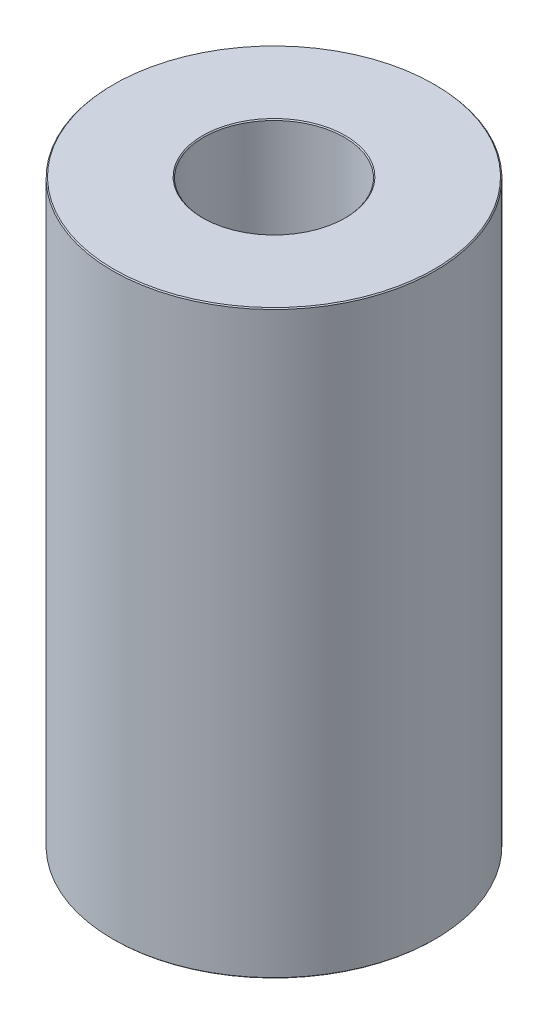
ISO-10303-21;
HEADER;
FILE_DESCRIPTION(('STEP AP214'),'2;1');
FILE_NAME('part.step','',(''),(''),'','','');
FILE_SCHEMA(('AUTOMOTIVE_DESIGN { 1 0 10303 214 1 1 1 1 }'));
ENDSEC;
DATA;
#1=APPLICATION_CONTEXT('core data for automotive mechanical design processes');
#2=APPLICATION_PROTOCOL_DEFINITION('international standard','automotive_design',2000,#1);
#3=PRODUCT_CONTEXT('',#1,'mechanical');
#4=PRODUCT('Part','Part','',(#3));
#5=PRODUCT_RELATED_PRODUCT_CATEGORY('part','',(#4));
#6=PRODUCT_DEFINITION_FORMATION('','',#4);
#7=PRODUCT_DEFINITION_CONTEXT('part definition',#1,'design');
#8=PRODUCT_DEFINITION('design','',#6,#7);
#9=PRODUCT_DEFINITION_SHAPE('','',#8);
#10=(LENGTH_UNIT() NAMED_UNIT(*) SI_UNIT(.MILLI.,.METRE.));
#11=(NAMED_UNIT(*) PLANE_ANGLE_UNIT() SI_UNIT($,.RADIAN.));
#12=(NAMED_UNIT(*) SI_UNIT($,.STERADIAN.) SOLID_ANGLE_UNIT());
#13=UNCERTAINTY_MEASURE_WITH_UNIT(LENGTH_MEASURE(1.E-05),#10,'distance_accuracy_value','');
#14=(GEOMETRIC_REPRESENTATION_CONTEXT(3) GLOBAL_UNCERTAINTY_ASSIGNED_CONTEXT((#13)) GLOBAL_UNIT_ASSIGNED_CONTEXT((#10,
#11,#12)) REPRESENTATION_CONTEXT('',''));
#15=CARTESIAN_POINT('',(0.,0.,0.));
#16=DIRECTION('',(0.,0.,1.));
#17=DIRECTION('',(1.,0.,0.));
#18=AXIS2_PLACEMENT_3D('',#15,#16,#17);
#19=CARTESIAN_POINT('',(0.,216.148202146825,0.));
#20=DIRECTION('',(0.,-1.,0.));
#21=DIRECTION('',(0.,0.,-1.));
#22=AXIS2_PLACEMENT_3D('',#19,#20,#21);
#23=CYLINDRICAL_SURFACE('',#22,60.);
#24=CARTESIAN_POINT('',(0.,0.368936859768521,0.));
#25=DIRECTION('',(0.,1.,0.));
#26=DIRECTION('',(0.,0.,1.));
#27=AXIS2_PLACEMENT_3D('',#24,#25,#26);
#28=CIRCLE('',#27,60.);
#29=CARTESIAN_POINT('',(0.,0.368936859768493,-60.));
#30=VERTEX_POINT('',#29);
#31=EDGE_CURVE('E10',#30,#30,#28,.T.);
#32=CARTESIAN_POINT('',(0.,215.779265287057,0.));
#33=DIRECTION('',(0.,1.,0.));
#34=DIRECTION('',(0.,0.,1.));
#35=AXIS2_PLACEMENT_3D('',#32,#33,#34);
#36=CIRCLE('',#35,60.);
#37=CARTESIAN_POINT('',(0.,215.779265287057,-60.));
#38=VERTEX_POINT('',#37);
#39=EDGE_CURVE('E50',#38,#38,#36,.F.);
#40=CARTESIAN_POINT('',(0.,0.368936859768493,-60.));
#41=CARTESIAN_POINT('',(0.,2.61279444755275,-60.));
#42=CARTESIAN_POINT('',(0.,4.856652035337,-60.));
#43=CARTESIAN_POINT('',(0.,9.34436721090551,-60.));
#44=CARTESIAN_POINT('',(0.,11.5882247986898,-60.));
#45=CARTESIAN_POINT('',(0.,16.0759399742583,-60.));
#46=CARTESIAN_POINT('',(0.,18.3197975620425,-60.));
#47=CARTESIAN_POINT('',(0.,22.807512737611,-60.));
#48=CARTESIAN_POINT('',(0.,25.0513703253953,-60.));
#49=CARTESIAN_POINT('',(0.,29.5390855009638,-60.));
#50=CARTESIAN_POINT('',(0.,31.782943088748,-60.));
#51=CARTESIAN_POINT('',(0.,36.2706582643165,-60.));
#52=CARTESIAN_POINT('',(0.,38.5145158521008,-60.));
#53=CARTESIAN_POINT('',(0.,43.0022310276693,-60.));
#54=CARTESIAN_POINT('',(0.,45.2460886154535,-60.));
#55=CARTESIAN_POINT('',(0.,49.733803791022,-60.));
#56=CARTESIAN_POINT('',(0.,51.9776613788063,-60.));
#57=CARTESIAN_POINT('',(0.,56.4653765543748,-60.));
#58=CARTESIAN_POINT('',(0.,58.709234142159,-60.));
#59=CARTESIAN_POINT('',(0.,63.1969493177275,-60.));
#60=CARTESIAN_POINT('',(0.,65.4408069055118,-60.));
#61=CARTESIAN_POINT('',(0.,69.9285220810803,-60.));
#62=CARTESIAN_POINT('',(0.,72.1723796688646,-60.));
#63=CARTESIAN_POINT('',(0.,76.6600948444331,-60.));
#64=CARTESIAN_POINT('',(0.,78.9039524322173,-60.));
#65=CARTESIAN_POINT('',(0.,83.3916676077858,-60.));
#66=CARTESIAN_POINT('',(0.,85.6355251955701,-60.));
#67=CARTESIAN_POINT('',(0.,90.1232403711386,-60.));
#68=CARTESIAN_POINT('',(0.,92.3670979589228,-60.));
#69=CARTESIAN_POINT('',(0.,96.8548131344913,-60.));
#70=CARTESIAN_POINT('',(0.,99.0986707222756,-60.));
#71=CARTESIAN_POINT('',(0.,103.586385897844,-60.));
#72=CARTESIAN_POINT('',(0.,105.830243485628,-60.));
#73=CARTESIAN_POINT('',(0.,110.317958661197,-60.));
#74=CARTESIAN_POINT('',(0.,112.561816248981,-60.));
#75=CARTESIAN_POINT('',(0.,117.04953142455,-60.));
#76=CARTESIAN_POINT('',(0.,119.293389012334,-60.));
#77=CARTESIAN_POINT('',(0.,123.781104187902,-60.));
#78=CARTESIAN_POINT('',(0.,126.024961775687,-60.));
#79=CARTESIAN_POINT('',(0.,130.512676951255,-60.));
#80=CARTESIAN_POINT('',(0.,132.756534539039,-60.));
#81=CARTESIAN_POINT('',(0.,137.244249714608,-60.));
#82=CARTESIAN_POINT('',(0.,139.488107302392,-60.));
#83=CARTESIAN_POINT('',(0.,143.975822477961,-60.));
#84=CARTESIAN_POINT('',(0.,146.219680065745,-60.));
#85=CARTESIAN_POINT('',(0.,150.707395241313,-60.));
#86=CARTESIAN_POINT('',(0.,152.951252829098,-60.));
#87=CARTESIAN_POINT('',(0.,157.438968004666,-60.));
#88=CARTESIAN_POINT('',(0.,159.68282559245,-60.));
#89=CARTESIAN_POINT('',(0.,164.170540768019,-60.));
#90=CARTESIAN_POINT('',(0.,166.414398355803,-60.));
#91=CARTESIAN_POINT('',(0.,170.902113531372,-60.));
#92=CARTESIAN_POINT('',(0.,173.145971119156,-60.));
#93=CARTESIAN_POINT('',(0.,177.633686294724,-60.));
#94=CARTESIAN_POINT('',(0.,179.877543882509,-60.));
#95=CARTESIAN_POINT('',(0.,184.365259058077,-60.));
#96=CARTESIAN_POINT('',(0.,186.609116645861,-60.));
#97=CARTESIAN_POINT('',(0.,191.09683182143,-60.));
#98=CARTESIAN_POINT('',(0.,193.340689409214,-60.));
#99=CARTESIAN_POINT('',(0.,197.828404584783,-60.));
#100=CARTESIAN_POINT('',(0.,200.072262172567,-60.));
#101=CARTESIAN_POINT('',(0.,204.559977348135,-60.));
#102=CARTESIAN_POINT('',(0.,206.80383493592,-60.));
#103=CARTESIAN_POINT('',(0.,211.291550111488,-60.));
#104=CARTESIAN_POINT('',(0.,213.535407699272,-60.));
#105=CARTESIAN_POINT('',(0.,215.779265287057,-60.));
#106=B_SPLINE_CURVE_WITH_KNOTS('',3,(#40,#41,#42,#43,#44,#45,#46,#47,#48,#49,#50,#51,#52,#53,
#54,#55,#56,#57,#58,#59,#60,#61,#62,#63,#64,#65,#66,#67,#68,#69,#70,#71,#72,#73,#74,#75,#76,#77,
#78,#79,#80,#81,#82,#83,#84,#85,#86,#87,#88,#89,#90,#91,#92,#93,#94,#95,#96,#97,#98,#99,#100,
#101,#102,#103,#104,#105),.UNSPECIFIED.,.F.,.F.,(4,2,2,2,2,2,2,2,2,2,2,2,2,2,2,2,2,2,2,2,2,2,2,
2,2,2,2,2,2,2,2,2,4),(0.,6.73157276335276,13.4631455267055,20.1947182900583,26.926291053411,
33.6578638167638,40.3894365801165,47.1210093434693,53.852582106822,60.5841548701748,
67.3157276335276,74.0473003968803,80.7788731602331,87.5104459235858,94.2420186869386,
100.973591450291,107.705164213644,114.436736976997,121.16830974035,127.899882503702,
134.631455267055,141.363028030408,148.094600793761,154.826173557113,161.557746320466,
168.289319083819,175.020891847172,181.752464610524,188.484037373877,195.21561013723,
201.947182900583,208.678755663935,215.410328427288),.UNSPECIFIED.);
#107=EDGE_CURVE('BSEAM39',#30,#38,#106,.T.);
#108=ORIENTED_EDGE('',*,*,#31,.T.);
#109=ORIENTED_EDGE('',*,*,#39,.T.);
#110=ORIENTED_EDGE('',*,*,#107,.T.);
#111=ORIENTED_EDGE('',*,*,#107,.F.);
#112=EDGE_LOOP('',(#108,#110,#109,#111));
#113=FACE_BOUND('',#112,.T.);
#114=ADVANCED_FACE('F39',(#113),#23,.T.);
#115=CARTESIAN_POINT('',(0.,216.148202146825,0.));
#116=DIRECTION('',(0.,1.,0.));
#117=DIRECTION('',(0.,0.,1.));
#118=AXIS2_PLACEMENT_3D('',#115,#116,#117);
#119=PLANE('',#118);
#120=CARTESIAN_POINT('',(0.,216.148202146825,0.));
#121=DIRECTION('',(0.,1.,0.));
#122=DIRECTION('',(0.,0.,1.));
#123=AXIS2_PLACEMENT_3D('',#120,#121,#122);
#124=CIRCLE('',#123,26.5738012088122);
#125=CARTESIAN_POINT('',(0.,216.148202146825,26.5738012088122));
#126=VERTEX_POINT('',#125);
#127=EDGE_CURVE('E58',#126,#126,#124,.F.);
#128=ORIENTED_EDGE('',*,*,#127,.T.);
#129=EDGE_LOOP('',(#128));
#130=FACE_BOUND('',#129,.T.);
#131=CARTESIAN_POINT('',(0.,216.148202146825,0.));
#132=DIRECTION('',(0.,1.,0.));
#133=DIRECTION('',(0.,0.,1.));
#134=AXIS2_PLACEMENT_3D('',#131,#132,#133);
#135=CIRCLE('',#134,59.6310631402319);
#136=CARTESIAN_POINT('',(0.,216.148202146825,59.6310631402319));
#137=VERTEX_POINT('',#136);
#138=EDGE_CURVE('E61',#137,#137,#135,.T.);
#139=ORIENTED_EDGE('',*,*,#138,.T.);
#140=EDGE_LOOP('',(#139));
#141=FACE_BOUND('',#140,.T.);
#142=ADVANCED_FACE('F88',(#130,#141),#119,.T.);
#143=CARTESIAN_POINT('',(0.,0.,0.));
#144=DIRECTION('',(0.,1.,0.));
#145=DIRECTION('',(0.,0.,1.));
#146=AXIS2_PLACEMENT_3D('',#143,#144,#145);
#147=PLANE('',#146);
#148=CARTESIAN_POINT('',(0.,0.,0.));
#149=DIRECTION('',(0.,1.,0.));
#150=DIRECTION('',(0.,0.,1.));
#151=AXIS2_PLACEMENT_3D('',#148,#149,#150);
#152=CIRCLE('',#151,26.573801208812);
#153=CARTESIAN_POINT('',(0.,0.,26.573801208812));
#154=VERTEX_POINT('',#153);
#155=EDGE_CURVE('E51',#154,#154,#152,.T.);
#156=ORIENTED_EDGE('',*,*,#155,.T.);
#157=EDGE_LOOP('',(#156));
#158=FACE_BOUND('',#157,.T.);
#159=CARTESIAN_POINT('',(0.,0.,0.));
#160=DIRECTION('',(0.,1.,0.));
#161=DIRECTION('',(0.,0.,1.));
#162=AXIS2_PLACEMENT_3D('',#159,#160,#161);
#163=CIRCLE('',#162,59.6310631402315);
#164=CARTESIAN_POINT('',(0.,0.,59.6310631402315));
#165=VERTEX_POINT('',#164);
#166=EDGE_CURVE('E54',#165,#165,#163,.F.);
#167=ORIENTED_EDGE('',*,*,#166,.T.);
#168=EDGE_LOOP('',(#167));
#169=FACE_BOUND('',#168,.T.);
#170=ADVANCED_FACE('F83',(#158,#169),#147,.F.);
#171=CARTESIAN_POINT('',(0.,216.148202146825,0.));
#172=DIRECTION('',(0.,-1.,0.));
#173=DIRECTION('',(0.,0.,-1.));
#174=AXIS2_PLACEMENT_3D('',#171,#172,#173);
#175=CYLINDRICAL_SURFACE('',#174,26.2048643490438);
#176=CARTESIAN_POINT('',(0.,215.779265287056,0.));
#177=DIRECTION('',(0.,1.,0.));
#178=DIRECTION('',(0.,0.,1.));
#179=AXIS2_PLACEMENT_3D('',#176,#177,#178);
#180=CIRCLE('',#179,26.2048643490438);
#181=CARTESIAN_POINT('',(0.,215.779265287056,-26.2048643490438));
#182=VERTEX_POINT('',#181);
#183=EDGE_CURVE('E67',#182,#182,#180,.T.);
#184=CARTESIAN_POINT('',(0.,0.368936859768215,0.));
#185=DIRECTION('',(0.,1.,0.));
#186=DIRECTION('',(0.,0.,1.));
#187=AXIS2_PLACEMENT_3D('',#184,#185,#186);
#188=CIRCLE('',#187,26.2048643490438);
#189=CARTESIAN_POINT('',(0.,0.368936859768215,-26.2048643490438));
#190=VERTEX_POINT('',#189);
#191=EDGE_CURVE('E69',#190,#190,#188,.F.);
#192=CARTESIAN_POINT('',(0.,215.779265287056,-26.2048643490438));
#193=CARTESIAN_POINT('',(0.,213.535407699272,-26.2048643490438));
#194=CARTESIAN_POINT('',(0.,211.291550111488,-26.2048643490438));
#195=CARTESIAN_POINT('',(0.,206.803834935919,-26.2048643490438));
#196=CARTESIAN_POINT('',(0.,204.559977348135,-26.2048643490438));
#197=CARTESIAN_POINT('',(0.,200.072262172567,-26.2048643490438));
#198=CARTESIAN_POINT('',(0.,197.828404584782,-26.2048643490438));
#199=CARTESIAN_POINT('',(0.,193.340689409214,-26.2048643490438));
#200=CARTESIAN_POINT('',(0.,191.09683182143,-26.2048643490438));
#201=CARTESIAN_POINT('',(0.,186.609116645861,-26.2048643490438));
#202=CARTESIAN_POINT('',(0.,184.365259058077,-26.2048643490438));
#203=CARTESIAN_POINT('',(0.,179.877543882508,-26.2048643490438));
#204=CARTESIAN_POINT('',(0.,177.633686294724,-26.2048643490438));
#205=CARTESIAN_POINT('',(0.,173.145971119156,-26.2048643490438));
#206=CARTESIAN_POINT('',(0.,170.902113531371,-26.2048643490438));
#207=CARTESIAN_POINT('',(0.,166.414398355803,-26.2048643490438));
#208=CARTESIAN_POINT('',(0.,164.170540768019,-26.2048643490438));
#209=CARTESIAN_POINT('',(0.,159.68282559245,-26.2048643490438));
#210=CARTESIAN_POINT('',(0.,157.438968004666,-26.2048643490438));
#211=CARTESIAN_POINT('',(0.,152.951252829097,-26.2048643490438));
#212=CARTESIAN_POINT('',(0.,150.707395241313,-26.2048643490438));
#213=CARTESIAN_POINT('',(0.,146.219680065745,-26.2048643490438));
#214=CARTESIAN_POINT('',(0.,143.97582247796,-26.2048643490438));
#215=CARTESIAN_POINT('',(0.,139.488107302392,-26.2048643490438));
#216=CARTESIAN_POINT('',(0.,137.244249714608,-26.2048643490438));
#217=CARTESIAN_POINT('',(0.,132.756534539039,-26.2048643490438));
#218=CARTESIAN_POINT('',(0.,130.512676951255,-26.2048643490438));
#219=CARTESIAN_POINT('',(0.,126.024961775686,-26.2048643490438));
#220=CARTESIAN_POINT('',(0.,123.781104187902,-26.2048643490438));
#221=CARTESIAN_POINT('',(0.,119.293389012334,-26.2048643490438));
#222=CARTESIAN_POINT('',(0.,117.049531424549,-26.2048643490438));
#223=CARTESIAN_POINT('',(0.,112.561816248981,-26.2048643490438));
#224=CARTESIAN_POINT('',(0.,110.317958661197,-26.2048643490438));
#225=CARTESIAN_POINT('',(0.,105.830243485628,-26.2048643490438));
#226=CARTESIAN_POINT('',(0.,103.586385897844,-26.2048643490438));
#227=CARTESIAN_POINT('',(0.,99.0986707222753,-26.2048643490438));
#228=CARTESIAN_POINT('',(0.,96.854813134491,-26.2048643490438));
#229=CARTESIAN_POINT('',(0.,92.3670979589225,-26.2048643490438));
#230=CARTESIAN_POINT('',(0.,90.1232403711383,-26.2048643490438));
#231=CARTESIAN_POINT('',(0.,85.6355251955698,-26.2048643490438));
#232=CARTESIAN_POINT('',(0.,83.3916676077855,-26.2048643490438));
#233=CARTESIAN_POINT('',(0.,78.903952432217,-26.2048643490438));
#234=CARTESIAN_POINT('',(0.,76.6600948444328,-26.2048643490438));
#235=CARTESIAN_POINT('',(0.,72.1723796688643,-26.2048643490438));
#236=CARTESIAN_POINT('',(0.,69.92852208108,-26.2048643490438));
#237=CARTESIAN_POINT('',(0.,65.4408069055115,-26.2048643490438));
#238=CARTESIAN_POINT('',(0.,63.1969493177273,-26.2048643490438));
#239=CARTESIAN_POINT('',(0.,58.7092341421588,-26.2048643490438));
#240=CARTESIAN_POINT('',(0.,56.4653765543745,-26.2048643490438));
#241=CARTESIAN_POINT('',(0.,51.977661378806,-26.2048643490438));
#242=CARTESIAN_POINT('',(0.,49.7338037910217,-26.2048643490438));
#243=CARTESIAN_POINT('',(0.,45.2460886154532,-26.2048643490438));
#244=CARTESIAN_POINT('',(0.,43.002231027669,-26.2048643490438));
#245=CARTESIAN_POINT('',(0.,38.5145158521005,-26.2048643490438));
#246=CARTESIAN_POINT('',(0.,36.2706582643162,-26.2048643490438));
#247=CARTESIAN_POINT('',(0.,31.7829430887477,-26.2048643490438));
#248=CARTESIAN_POINT('',(0.,29.5390855009635,-26.2048643490438));
#249=CARTESIAN_POINT('',(0.,25.051370325395,-26.2048643490438));
#250=CARTESIAN_POINT('',(0.,22.8075127376107,-26.2048643490438));
#251=CARTESIAN_POINT('',(0.,18.3197975620422,-26.2048643490438));
#252=CARTESIAN_POINT('',(0.,16.075939974258,-26.2048643490438));
#253=CARTESIAN_POINT('',(0.,11.5882247986895,-26.2048643490438));
#254=CARTESIAN_POINT('',(0.,9.34436721090523,-26.2048643490438));
#255=CARTESIAN_POINT('',(0.,4.85665203533672,-26.2048643490438));
#256=CARTESIAN_POINT('',(0.,2.61279444755247,-26.2048643490438));
#257=CARTESIAN_POINT('',(0.,0.368936859768215,-26.2048643490438));
#258=B_SPLINE_CURVE_WITH_KNOTS('',3,(#192,#193,#194,#195,#196,#197,#198,#199,#200,#201,#202,
#203,#204,#205,#206,#207,#208,#209,#210,#211,#212,#213,#214,#215,#216,#217,#218,#219,#220,#221,
#222,#223,#224,#225,#226,#227,#228,#229,#230,#231,#232,#233,#234,#235,#236,#237,#238,#239,#240,
#241,#242,#243,#244,#245,#246,#247,#248,#249,#250,#251,#252,#253,#254,#255,#256,#257),
.UNSPECIFIED.,.F.,.F.,(4,2,2,2,2,2,2,2,2,2,2,2,2,2,2,2,2,2,2,2,2,2,2,2,2,2,2,2,2,2,2,2,4),(0.,
6.73157276335273,13.4631455267055,20.1947182900583,26.926291053411,33.6578638167638,
40.3894365801165,47.1210093434693,53.852582106822,60.5841548701748,67.3157276335275,
74.0473003968803,80.778873160233,87.5104459235858,94.2420186869386,100.973591450291,
107.705164213644,114.436736976997,121.16830974035,127.899882503702,134.631455267055,
141.363028030408,148.094600793761,154.826173557113,161.557746320466,168.289319083819,
175.020891847172,181.752464610524,188.484037373877,195.21561013723,201.947182900583,
208.678755663935,215.410328427288),.UNSPECIFIED.);
#259=EDGE_CURVE('BSEAM71',#182,#190,#258,.T.);
#260=ORIENTED_EDGE('',*,*,#183,.T.);
#261=ORIENTED_EDGE('',*,*,#191,.T.);
#262=ORIENTED_EDGE('',*,*,#259,.T.);
#263=ORIENTED_EDGE('',*,*,#259,.F.);
#264=EDGE_LOOP('',(#260,#262,#261,#263));
#265=FACE_BOUND('',#264,.T.);
#266=ADVANCED_FACE('F71',(#265),#175,.F.);
#267=CARTESIAN_POINT('',(0.,215.779265287056,0.));
#268=DIRECTION('',(0.,1.,0.));
#269=DIRECTION('',(0.,0.,1.));
#270=AXIS2_PLACEMENT_3D('',#267,#268,#269);
#271=CONICAL_SURFACE('',#270,26.2048643490438,0.785398163397439);
#272=ORIENTED_EDGE('',*,*,#127,.F.);
#273=EDGE_LOOP('',(#272));
#274=FACE_BOUND('',#273,.T.);
#275=ORIENTED_EDGE('',*,*,#183,.F.);
#276=EDGE_LOOP('',(#275));
#277=FACE_BOUND('',#276,.T.);
#278=ADVANCED_FACE('F77',(#274,#277),#271,.F.);
#279=CARTESIAN_POINT('',(0.,0.,0.));
#280=DIRECTION('',(0.,-1.,0.));
#281=DIRECTION('',(0.,0.,-1.));
#282=AXIS2_PLACEMENT_3D('',#279,#280,#281);
#283=CONICAL_SURFACE('',#282,26.573801208812,0.785398163397406);
#284=ORIENTED_EDGE('',*,*,#191,.F.);
#285=EDGE_LOOP('',(#284));
#286=FACE_BOUND('',#285,.T.);
#287=ORIENTED_EDGE('',*,*,#155,.F.);
#288=EDGE_LOOP('',(#287));
#289=FACE_BOUND('',#288,.T.);
#290=ADVANCED_FACE('F73',(#286,#289),#283,.F.);
#291=CARTESIAN_POINT('',(0.,0.368936859768521,0.));
#292=DIRECTION('',(0.,1.,0.));
#293=DIRECTION('',(0.,0.,1.));
#294=AXIS2_PLACEMENT_3D('',#291,#292,#293);
#295=CONICAL_SURFACE('',#294,60.,0.78539816339743);
#296=ORIENTED_EDGE('',*,*,#166,.F.);
#297=EDGE_LOOP('',(#296));
#298=FACE_BOUND('',#297,.T.);
#299=ORIENTED_EDGE('',*,*,#31,.F.);
#300=EDGE_LOOP('',(#299));
#301=FACE_BOUND('',#300,.T.);
#302=ADVANCED_FACE('F76',(#298,#301),#295,.T.);
#303=CARTESIAN_POINT('',(0.,216.148202146825,0.));
#304=DIRECTION('',(0.,-1.,0.));
#305=DIRECTION('',(0.,0.,-1.));
#306=AXIS2_PLACEMENT_3D('',#303,#304,#305);
#307=CONICAL_SURFACE('',#306,59.6310631402319,0.785398163397458);
#308=ORIENTED_EDGE('',*,*,#39,.F.);
#309=EDGE_LOOP('',(#308));
#310=FACE_BOUND('',#309,.T.);
#311=ORIENTED_EDGE('',*,*,#138,.F.);
#312=EDGE_LOOP('',(#311));
#313=FACE_BOUND('',#312,.T.);
#314=ADVANCED_FACE('F45',(#310,#313),#307,.T.);
#315=CLOSED_SHELL('',(#114,#142,#170,#266,#278,#290,#302,#314));
#316=MANIFOLD_SOLID_BREP('B2',#315);
#317=ADVANCED_BREP_SHAPE_REPRESENTATION('',(#18,#316),#14);
#318=SHAPE_DEFINITION_REPRESENTATION(#9,#317);
ENDSEC;
END-ISO-10303-21;
